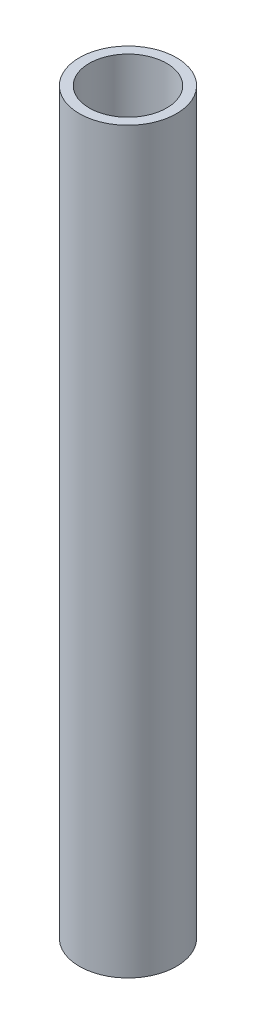
ISO-10303-21;
HEADER;
FILE_DESCRIPTION(('STEP AP214'),'2;1');
FILE_NAME('part.step','',(''),(''),'','','');
FILE_SCHEMA(('AUTOMOTIVE_DESIGN { 1 0 10303 214 1 1 1 1 }'));
ENDSEC;
DATA;
#1=APPLICATION_CONTEXT('core data for automotive mechanical design processes');
#2=APPLICATION_PROTOCOL_DEFINITION('international standard','automotive_design',2000,#1);
#3=PRODUCT_CONTEXT('',#1,'mechanical');
#4=PRODUCT('Part','Part','',(#3));
#5=PRODUCT_RELATED_PRODUCT_CATEGORY('part','',(#4));
#6=PRODUCT_DEFINITION_FORMATION('','',#4);
#7=PRODUCT_DEFINITION_CONTEXT('part definition',#1,'design');
#8=PRODUCT_DEFINITION('design','',#6,#7);
#9=PRODUCT_DEFINITION_SHAPE('','',#8);
#10=(LENGTH_UNIT() NAMED_UNIT(*) SI_UNIT(.MILLI.,.METRE.));
#11=(NAMED_UNIT(*) PLANE_ANGLE_UNIT() SI_UNIT($,.RADIAN.));
#12=(NAMED_UNIT(*) SI_UNIT($,.STERADIAN.) SOLID_ANGLE_UNIT());
#13=UNCERTAINTY_MEASURE_WITH_UNIT(LENGTH_MEASURE(1.E-05),#10,'distance_accuracy_value','');
#14=(GEOMETRIC_REPRESENTATION_CONTEXT(3) GLOBAL_UNCERTAINTY_ASSIGNED_CONTEXT((#13)) GLOBAL_UNIT_ASSIGNED_CONTEXT((#10,
#11,#12)) REPRESENTATION_CONTEXT('',''));
#15=CARTESIAN_POINT('',(0.,0.,0.));
#16=DIRECTION('',(0.,0.,1.));
#17=DIRECTION('',(1.,0.,0.));
#18=AXIS2_PLACEMENT_3D('',#15,#16,#17);
#19=CARTESIAN_POINT('',(0.,254.,0.));
#20=DIRECTION('',(0.,1.,0.));
#21=DIRECTION('',(0.,0.,1.));
#22=AXIS2_PLACEMENT_3D('',#19,#20,#21);
#23=PLANE('',#22);
#24=CARTESIAN_POINT('',(0.,254.,0.));
#25=DIRECTION('',(0.,1.,0.));
#26=DIRECTION('',(0.,0.,1.));
#27=AXIS2_PLACEMENT_3D('',#24,#25,#26);
#28=CIRCLE('',#27,16.7005);
#29=CARTESIAN_POINT('',(0.,254.,16.7005));
#30=VERTEX_POINT('',#29);
#31=EDGE_CURVE('E10',#30,#30,#28,.T.);
#32=ORIENTED_EDGE('',*,*,#31,.T.);
#33=EDGE_LOOP('',(#32));
#34=FACE_BOUND('',#33,.T.);
#35=CARTESIAN_POINT('',(0.,254.,0.));
#36=DIRECTION('',(0.,1.,0.));
#37=DIRECTION('',(0.,0.,1.));
#38=AXIS2_PLACEMENT_3D('',#35,#36,#37);
#39=CIRCLE('',#38,13.3223);
#40=CARTESIAN_POINT('',(0.,254.,13.3223));
#41=VERTEX_POINT('',#40);
#42=EDGE_CURVE('E39',#41,#41,#39,.T.);
#43=ORIENTED_EDGE('',*,*,#42,.F.);
#44=EDGE_LOOP('',(#43));
#45=FACE_BOUND('',#44,.T.);
#46=ADVANCED_FACE('F28',(#34,#45),#23,.T.);
#47=CARTESIAN_POINT('',(0.,0.,0.));
#48=DIRECTION('',(0.,1.,0.));
#49=DIRECTION('',(0.,0.,1.));
#50=AXIS2_PLACEMENT_3D('',#47,#48,#49);
#51=PLANE('',#50);
#52=CARTESIAN_POINT('',(0.,0.,0.));
#53=DIRECTION('',(0.,1.,0.));
#54=DIRECTION('',(0.,0.,1.));
#55=AXIS2_PLACEMENT_3D('',#52,#53,#54);
#56=CIRCLE('',#55,16.7005);
#57=CARTESIAN_POINT('',(0.,0.,16.7005));
#58=VERTEX_POINT('',#57);
#59=EDGE_CURVE('E32',#58,#58,#56,.T.);
#60=ORIENTED_EDGE('',*,*,#59,.F.);
#61=EDGE_LOOP('',(#60));
#62=FACE_BOUND('',#61,.T.);
#63=CARTESIAN_POINT('',(0.,0.,0.));
#64=DIRECTION('',(0.,1.,0.));
#65=DIRECTION('',(0.,0.,1.));
#66=AXIS2_PLACEMENT_3D('',#63,#64,#65);
#67=CIRCLE('',#66,13.3223);
#68=CARTESIAN_POINT('',(0.,0.,13.3223));
#69=VERTEX_POINT('',#68);
#70=EDGE_CURVE('E41',#69,#69,#67,.T.);
#71=ORIENTED_EDGE('',*,*,#70,.T.);
#72=EDGE_LOOP('',(#71));
#73=FACE_BOUND('',#72,.T.);
#74=ADVANCED_FACE('F51',(#62,#73),#51,.F.);
#75=CARTESIAN_POINT('',(0.,254.,0.));
#76=DIRECTION('',(0.,-1.,0.));
#77=DIRECTION('',(0.,0.,-1.));
#78=AXIS2_PLACEMENT_3D('',#75,#76,#77);
#79=CYLINDRICAL_SURFACE('',#78,16.7005);
#80=ORIENTED_EDGE('',*,*,#31,.F.);
#81=EDGE_LOOP('',(#80));
#82=FACE_BOUND('',#81,.T.);
#83=ORIENTED_EDGE('',*,*,#59,.T.);
#84=EDGE_LOOP('',(#83));
#85=FACE_BOUND('',#84,.T.);
#86=ADVANCED_FACE('F30',(#82,#85),#79,.T.);
#87=CARTESIAN_POINT('',(0.,254.,0.));
#88=DIRECTION('',(0.,-1.,0.));
#89=DIRECTION('',(0.,0.,-1.));
#90=AXIS2_PLACEMENT_3D('',#87,#88,#89);
#91=CYLINDRICAL_SURFACE('',#90,13.3223);
#92=ORIENTED_EDGE('',*,*,#42,.T.);
#93=EDGE_LOOP('',(#92));
#94=FACE_BOUND('',#93,.T.);
#95=ORIENTED_EDGE('',*,*,#70,.F.);
#96=EDGE_LOOP('',(#95));
#97=FACE_BOUND('',#96,.T.);
#98=ADVANCED_FACE('F47',(#94,#97),#91,.F.);
#99=CLOSED_SHELL('',(#46,#74,#86,#98));
#100=MANIFOLD_SOLID_BREP('B2',#99);
#101=ADVANCED_BREP_SHAPE_REPRESENTATION('',(#18,#100),#14);
#102=SHAPE_DEFINITION_REPRESENTATION(#9,#101);
ENDSEC;
END-ISO-10303-21;
